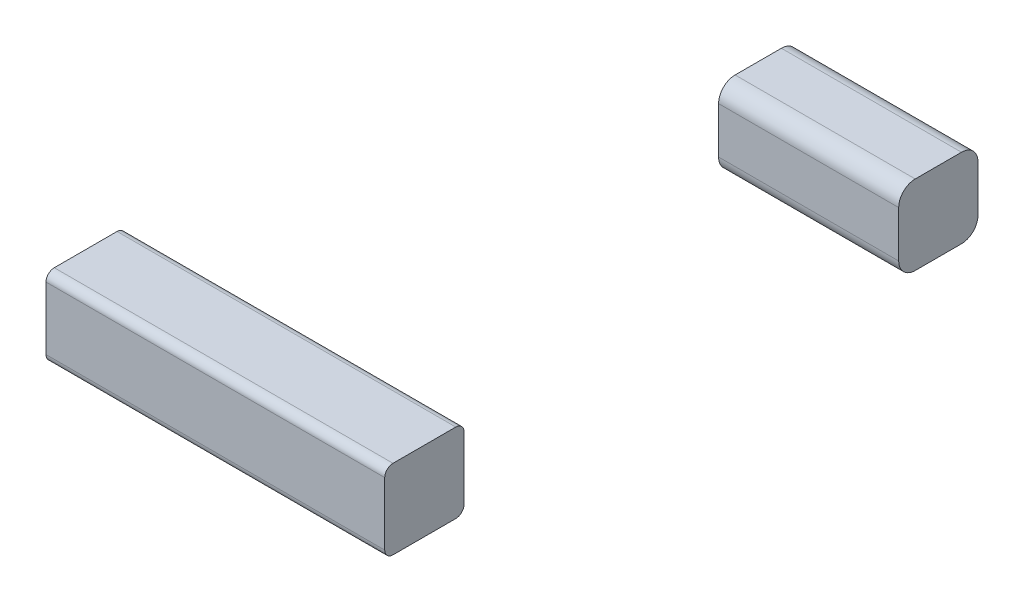
ISO-10303-21;
HEADER;
FILE_DESCRIPTION(('STEP AP214'),'2;1');
FILE_NAME('part.step','',(''),(''),'','','');
FILE_SCHEMA(('AUTOMOTIVE_DESIGN { 1 0 10303 214 1 1 1 1 }'));
ENDSEC;
DATA;
#1=APPLICATION_CONTEXT('core data for automotive mechanical design processes');
#2=APPLICATION_PROTOCOL_DEFINITION('international standard','automotive_design',2000,#1);
#3=PRODUCT_CONTEXT('',#1,'mechanical');
#4=PRODUCT('Part','Part','',(#3));
#5=PRODUCT_RELATED_PRODUCT_CATEGORY('part','',(#4));
#6=PRODUCT_DEFINITION_FORMATION('','',#4);
#7=PRODUCT_DEFINITION_CONTEXT('part definition',#1,'design');
#8=PRODUCT_DEFINITION('design','',#6,#7);
#9=PRODUCT_DEFINITION_SHAPE('','',#8);
#10=(LENGTH_UNIT() NAMED_UNIT(*) SI_UNIT(.MILLI.,.METRE.));
#11=(NAMED_UNIT(*) PLANE_ANGLE_UNIT() SI_UNIT($,.RADIAN.));
#12=(NAMED_UNIT(*) SI_UNIT($,.STERADIAN.) SOLID_ANGLE_UNIT());
#13=UNCERTAINTY_MEASURE_WITH_UNIT(LENGTH_MEASURE(1.E-05),#10,'distance_accuracy_value','');
#14=(GEOMETRIC_REPRESENTATION_CONTEXT(3) GLOBAL_UNCERTAINTY_ASSIGNED_CONTEXT((#13)) GLOBAL_UNIT_ASSIGNED_CONTEXT((#10,
#11,#12)) REPRESENTATION_CONTEXT('',''));
#15=CARTESIAN_POINT('',(0.,0.,0.));
#16=DIRECTION('',(0.,0.,1.));
#17=DIRECTION('',(1.,0.,0.));
#18=AXIS2_PLACEMENT_3D('',#15,#16,#17);
#19=CARTESIAN_POINT('',(10.9,0.,-62.9302493972376));
#20=DIRECTION('',(0.,0.,-1.));
#21=DIRECTION('',(-1.,0.,0.));
#22=AXIS2_PLACEMENT_3D('',#19,#20,#21);
#23=PLANE('',#22);
#24=DIRECTION('',(0.,-1.,0.));
#25=VECTOR('',#24,1.);
#26=CARTESIAN_POINT('',(0.,0.,-62.9302493972376));
#27=LINE('',#26,#25);
#28=CARTESIAN_POINT('',(0.,3.8,-62.9302493972376));
#29=VERTEX_POINT('',#28);
#30=CARTESIAN_POINT('',(0.,1.,-62.9302493972376));
#31=VERTEX_POINT('',#30);
#32=EDGE_CURVE('E140',#29,#31,#27,.T.);
#33=ORIENTED_EDGE('',*,*,#32,.T.);
#34=DIRECTION('',(-1.,0.,0.));
#35=VECTOR('',#34,1.);
#36=CARTESIAN_POINT('',(10.9,1.,-62.9302493972376));
#37=LINE('',#36,#35);
#38=CARTESIAN_POINT('',(10.9,1.,-62.9302493972376));
#39=VERTEX_POINT('',#38);
#40=EDGE_CURVE('E117',#31,#39,#37,.F.);
#41=ORIENTED_EDGE('',*,*,#40,.T.);
#42=DIRECTION('',(0.,-1.,0.));
#43=VECTOR('',#42,1.);
#44=CARTESIAN_POINT('',(10.9,0.,-62.9302493972376));
#45=LINE('',#44,#43);
#46=CARTESIAN_POINT('',(10.9,3.8,-62.9302493972376));
#47=VERTEX_POINT('',#46);
#48=EDGE_CURVE('E149',#47,#39,#45,.T.);
#49=ORIENTED_EDGE('',*,*,#48,.F.);
#50=DIRECTION('',(-1.,0.,0.));
#51=VECTOR('',#50,1.);
#52=CARTESIAN_POINT('',(10.9,3.8,-62.9302493972376));
#53=LINE('',#52,#51);
#54=EDGE_CURVE('E122',#47,#29,#53,.T.);
#55=ORIENTED_EDGE('',*,*,#54,.T.);
#56=EDGE_LOOP('',(#33,#41,#49,#55));
#57=FACE_BOUND('',#56,.T.);
#58=ADVANCED_FACE('F45',(#57),#23,.F.);
#59=CARTESIAN_POINT('',(10.9,0.,-62.9302493972376));
#60=DIRECTION('',(0.,1.,0.));
#61=DIRECTION('',(0.,0.,1.));
#62=AXIS2_PLACEMENT_3D('',#59,#60,#61);
#63=PLANE('',#62);
#64=DIRECTION('',(0.,0.,-1.));
#65=VECTOR('',#64,1.);
#66=CARTESIAN_POINT('',(10.9,0.,-62.9302493972376));
#67=LINE('',#66,#65);
#68=CARTESIAN_POINT('',(10.9,0.,-63.9302493972376));
#69=VERTEX_POINT('',#68);
#70=CARTESIAN_POINT('',(10.9,0.,-66.7302493972376));
#71=VERTEX_POINT('',#70);
#72=EDGE_CURVE('E132',#69,#71,#67,.T.);
#73=ORIENTED_EDGE('',*,*,#72,.F.);
#74=DIRECTION('',(-1.,0.,0.));
#75=VECTOR('',#74,1.);
#76=CARTESIAN_POINT('',(10.9,0.,-63.9302493972376));
#77=LINE('',#76,#75);
#78=CARTESIAN_POINT('',(0.,0.,-63.9302493972376));
#79=VERTEX_POINT('',#78);
#80=EDGE_CURVE('E116',#69,#79,#77,.T.);
#81=ORIENTED_EDGE('',*,*,#80,.T.);
#82=DIRECTION('',(0.,0.,-1.));
#83=VECTOR('',#82,1.);
#84=CARTESIAN_POINT('',(0.,0.,-62.9302493972376));
#85=LINE('',#84,#83);
#86=CARTESIAN_POINT('',(0.,0.,-66.7302493972376));
#87=VERTEX_POINT('',#86);
#88=EDGE_CURVE('E129',#79,#87,#85,.T.);
#89=ORIENTED_EDGE('',*,*,#88,.T.);
#90=DIRECTION('',(-1.,0.,0.));
#91=VECTOR('',#90,1.);
#92=CARTESIAN_POINT('',(10.9,0.,-66.7302493972376));
#93=LINE('',#92,#91);
#94=EDGE_CURVE('E134',#87,#71,#93,.F.);
#95=ORIENTED_EDGE('',*,*,#94,.T.);
#96=EDGE_LOOP('',(#73,#81,#89,#95));
#97=FACE_BOUND('',#96,.T.);
#98=ADVANCED_FACE('F128',(#97),#63,.F.);
#99=CARTESIAN_POINT('',(10.9,0.,-67.7302493972376));
#100=DIRECTION('',(0.,0.,1.));
#101=DIRECTION('',(1.,0.,0.));
#102=AXIS2_PLACEMENT_3D('',#99,#100,#101);
#103=PLANE('',#102);
#104=DIRECTION('',(0.,1.,0.));
#105=VECTOR('',#104,1.);
#106=CARTESIAN_POINT('',(10.9,0.,-67.7302493972376));
#107=LINE('',#106,#105);
#108=CARTESIAN_POINT('',(10.9,1.,-67.7302493972376));
#109=VERTEX_POINT('',#108);
#110=CARTESIAN_POINT('',(10.9,3.8,-67.7302493972376));
#111=VERTEX_POINT('',#110);
#112=EDGE_CURVE('E172',#109,#111,#107,.T.);
#113=ORIENTED_EDGE('',*,*,#112,.F.);
#114=DIRECTION('',(-1.,0.,0.));
#115=VECTOR('',#114,1.);
#116=CARTESIAN_POINT('',(10.9,1.,-67.7302493972376));
#117=LINE('',#116,#115);
#118=CARTESIAN_POINT('',(0.,1.,-67.7302493972376));
#119=VERTEX_POINT('',#118);
#120=EDGE_CURVE('E12',#109,#119,#117,.T.);
#121=ORIENTED_EDGE('',*,*,#120,.T.);
#122=DIRECTION('',(0.,1.,0.));
#123=VECTOR('',#122,1.);
#124=CARTESIAN_POINT('',(0.,0.,-67.7302493972376));
#125=LINE('',#124,#123);
#126=CARTESIAN_POINT('',(0.,3.8,-67.7302493972376));
#127=VERTEX_POINT('',#126);
#128=EDGE_CURVE('E139',#119,#127,#125,.T.);
#129=ORIENTED_EDGE('',*,*,#128,.T.);
#130=DIRECTION('',(-1.,0.,0.));
#131=VECTOR('',#130,1.);
#132=CARTESIAN_POINT('',(10.9,3.8,-67.7302493972376));
#133=LINE('',#132,#131);
#134=EDGE_CURVE('E53',#127,#111,#133,.F.);
#135=ORIENTED_EDGE('',*,*,#134,.T.);
#136=EDGE_LOOP('',(#113,#121,#129,#135));
#137=FACE_BOUND('',#136,.T.);
#138=ADVANCED_FACE('F171',(#137),#103,.F.);
#139=CARTESIAN_POINT('',(10.9,4.8,-62.9302493972376));
#140=DIRECTION('',(0.,-1.,0.));
#141=DIRECTION('',(0.,0.,-1.));
#142=AXIS2_PLACEMENT_3D('',#139,#140,#141);
#143=PLANE('',#142);
#144=DIRECTION('',(0.,0.,1.));
#145=VECTOR('',#144,1.);
#146=CARTESIAN_POINT('',(0.,4.8,-62.9302493972376));
#147=LINE('',#146,#145);
#148=CARTESIAN_POINT('',(0.,4.8,-66.7302493972376));
#149=VERTEX_POINT('',#148);
#150=CARTESIAN_POINT('',(0.,4.8,-63.9302493972376));
#151=VERTEX_POINT('',#150);
#152=EDGE_CURVE('E143',#149,#151,#147,.T.);
#153=ORIENTED_EDGE('',*,*,#152,.T.);
#154=DIRECTION('',(-1.,0.,0.));
#155=VECTOR('',#154,1.);
#156=CARTESIAN_POINT('',(10.9,4.8,-63.9302493972376));
#157=LINE('',#156,#155);
#158=CARTESIAN_POINT('',(10.9,4.8,-63.9302493972376));
#159=VERTEX_POINT('',#158);
#160=EDGE_CURVE('E60',#151,#159,#157,.F.);
#161=ORIENTED_EDGE('',*,*,#160,.T.);
#162=DIRECTION('',(0.,0.,1.));
#163=VECTOR('',#162,1.);
#164=CARTESIAN_POINT('',(10.9,4.8,-62.9302493972376));
#165=LINE('',#164,#163);
#166=CARTESIAN_POINT('',(10.9,4.8,-66.7302493972376));
#167=VERTEX_POINT('',#166);
#168=EDGE_CURVE('E150',#167,#159,#165,.T.);
#169=ORIENTED_EDGE('',*,*,#168,.F.);
#170=DIRECTION('',(-1.,0.,0.));
#171=VECTOR('',#170,1.);
#172=CARTESIAN_POINT('',(10.9,4.8,-66.7302493972376));
#173=LINE('',#172,#171);
#174=EDGE_CURVE('E165',#167,#149,#173,.T.);
#175=ORIENTED_EDGE('',*,*,#174,.T.);
#176=EDGE_LOOP('',(#153,#161,#169,#175));
#177=FACE_BOUND('',#176,.T.);
#178=ADVANCED_FACE('F181',(#177),#143,.F.);
#179=CARTESIAN_POINT('',(10.9,0.,0.));
#180=DIRECTION('',(-1.,0.,0.));
#181=DIRECTION('',(0.,0.,1.));
#182=AXIS2_PLACEMENT_3D('',#179,#180,#181);
#183=PLANE('',#182);
#184=ORIENTED_EDGE('',*,*,#48,.T.);
#185=CARTESIAN_POINT('',(10.9,1.,-63.9302493972376));
#186=DIRECTION('',(-1.,0.,0.));
#187=DIRECTION('',(0.,0.,1.));
#188=AXIS2_PLACEMENT_3D('',#185,#186,#187);
#189=CIRCLE('',#188,1.);
#190=EDGE_CURVE('E163',#39,#69,#189,.F.);
#191=ORIENTED_EDGE('',*,*,#190,.T.);
#192=ORIENTED_EDGE('',*,*,#72,.T.);
#193=CARTESIAN_POINT('',(10.9,1.,-66.7302493972376));
#194=DIRECTION('',(-1.,0.,0.));
#195=DIRECTION('',(0.,0.,1.));
#196=AXIS2_PLACEMENT_3D('',#193,#194,#195);
#197=CIRCLE('',#196,1.);
#198=EDGE_CURVE('E159',#71,#109,#197,.F.);
#199=ORIENTED_EDGE('',*,*,#198,.T.);
#200=ORIENTED_EDGE('',*,*,#112,.T.);
#201=CARTESIAN_POINT('',(10.9,3.8,-66.7302493972376));
#202=DIRECTION('',(-1.,0.,0.));
#203=DIRECTION('',(0.,0.,1.));
#204=AXIS2_PLACEMENT_3D('',#201,#202,#203);
#205=CIRCLE('',#204,1.);
#206=EDGE_CURVE('E67',#111,#167,#205,.F.);
#207=ORIENTED_EDGE('',*,*,#206,.T.);
#208=ORIENTED_EDGE('',*,*,#168,.T.);
#209=CARTESIAN_POINT('',(10.9,3.8,-63.9302493972376));
#210=DIRECTION('',(-1.,0.,0.));
#211=DIRECTION('',(0.,0.,1.));
#212=AXIS2_PLACEMENT_3D('',#209,#210,#211);
#213=CIRCLE('',#212,1.);
#214=EDGE_CURVE('E161',#159,#47,#213,.F.);
#215=ORIENTED_EDGE('',*,*,#214,.T.);
#216=EDGE_LOOP('',(#184,#191,#192,#199,#200,#207,#208,#215));
#217=FACE_BOUND('',#216,.T.);
#218=ADVANCED_FACE('F176',(#217),#183,.F.);
#219=CARTESIAN_POINT('',(0.,0.,0.));
#220=DIRECTION('',(-1.,0.,0.));
#221=DIRECTION('',(0.,0.,1.));
#222=AXIS2_PLACEMENT_3D('',#219,#220,#221);
#223=PLANE('',#222);
#224=ORIENTED_EDGE('',*,*,#88,.F.);
#225=CARTESIAN_POINT('',(0.,1.,-63.9302493972376));
#226=DIRECTION('',(-1.,0.,0.));
#227=DIRECTION('',(0.,0.,1.));
#228=AXIS2_PLACEMENT_3D('',#225,#226,#227);
#229=CIRCLE('',#228,1.);
#230=EDGE_CURVE('E112',#79,#31,#229,.T.);
#231=ORIENTED_EDGE('',*,*,#230,.T.);
#232=ORIENTED_EDGE('',*,*,#32,.F.);
#233=CARTESIAN_POINT('',(0.,3.8,-63.9302493972376));
#234=DIRECTION('',(-1.,0.,0.));
#235=DIRECTION('',(0.,0.,1.));
#236=AXIS2_PLACEMENT_3D('',#233,#234,#235);
#237=CIRCLE('',#236,1.);
#238=EDGE_CURVE('E123',#29,#151,#237,.T.);
#239=ORIENTED_EDGE('',*,*,#238,.T.);
#240=ORIENTED_EDGE('',*,*,#152,.F.);
#241=CARTESIAN_POINT('',(0.,3.8,-66.7302493972376));
#242=DIRECTION('',(-1.,0.,0.));
#243=DIRECTION('',(0.,0.,1.));
#244=AXIS2_PLACEMENT_3D('',#241,#242,#243);
#245=CIRCLE('',#244,1.);
#246=EDGE_CURVE('E133',#149,#127,#245,.T.);
#247=ORIENTED_EDGE('',*,*,#246,.T.);
#248=ORIENTED_EDGE('',*,*,#128,.F.);
#249=CARTESIAN_POINT('',(0.,1.,-66.7302493972376));
#250=DIRECTION('',(-1.,0.,0.));
#251=DIRECTION('',(0.,0.,1.));
#252=AXIS2_PLACEMENT_3D('',#249,#250,#251);
#253=CIRCLE('',#252,1.);
#254=EDGE_CURVE('E138',#119,#87,#253,.T.);
#255=ORIENTED_EDGE('',*,*,#254,.T.);
#256=EDGE_LOOP('',(#224,#231,#232,#239,#240,#247,#248,#255));
#257=FACE_BOUND('',#256,.T.);
#258=ADVANCED_FACE('F136',(#257),#223,.T.);
#259=CARTESIAN_POINT('',(10.9,1.,-63.9302493972376));
#260=DIRECTION('',(-1.,0.,0.));
#261=DIRECTION('',(0.,0.,1.));
#262=AXIS2_PLACEMENT_3D('',#259,#260,#261);
#263=CYLINDRICAL_SURFACE('',#262,1.);
#264=ORIENTED_EDGE('',*,*,#190,.F.);
#265=ORIENTED_EDGE('',*,*,#40,.F.);
#266=ORIENTED_EDGE('',*,*,#230,.F.);
#267=ORIENTED_EDGE('',*,*,#80,.F.);
#268=EDGE_LOOP('',(#264,#265,#266,#267));
#269=FACE_BOUND('',#268,.T.);
#270=ADVANCED_FACE('F115',(#269),#263,.T.);
#271=CARTESIAN_POINT('',(10.9,3.8,-63.9302493972376));
#272=DIRECTION('',(-1.,0.,0.));
#273=DIRECTION('',(0.,0.,1.));
#274=AXIS2_PLACEMENT_3D('',#271,#272,#273);
#275=CYLINDRICAL_SURFACE('',#274,1.);
#276=ORIENTED_EDGE('',*,*,#214,.F.);
#277=ORIENTED_EDGE('',*,*,#160,.F.);
#278=ORIENTED_EDGE('',*,*,#238,.F.);
#279=ORIENTED_EDGE('',*,*,#54,.F.);
#280=EDGE_LOOP('',(#276,#277,#278,#279));
#281=FACE_BOUND('',#280,.T.);
#282=ADVANCED_FACE('F185',(#281),#275,.T.);
#283=CARTESIAN_POINT('',(10.9,1.,-66.7302493972376));
#284=DIRECTION('',(-1.,0.,0.));
#285=DIRECTION('',(0.,0.,1.));
#286=AXIS2_PLACEMENT_3D('',#283,#284,#285);
#287=CYLINDRICAL_SURFACE('',#286,1.);
#288=ORIENTED_EDGE('',*,*,#198,.F.);
#289=ORIENTED_EDGE('',*,*,#94,.F.);
#290=ORIENTED_EDGE('',*,*,#254,.F.);
#291=ORIENTED_EDGE('',*,*,#120,.F.);
#292=EDGE_LOOP('',(#288,#289,#290,#291));
#293=FACE_BOUND('',#292,.T.);
#294=ADVANCED_FACE('F191',(#293),#287,.T.);
#295=CARTESIAN_POINT('',(10.9,3.8,-66.7302493972376));
#296=DIRECTION('',(-1.,0.,0.));
#297=DIRECTION('',(0.,0.,1.));
#298=AXIS2_PLACEMENT_3D('',#295,#296,#297);
#299=CYLINDRICAL_SURFACE('',#298,1.);
#300=ORIENTED_EDGE('',*,*,#206,.F.);
#301=ORIENTED_EDGE('',*,*,#134,.F.);
#302=ORIENTED_EDGE('',*,*,#246,.F.);
#303=ORIENTED_EDGE('',*,*,#174,.F.);
#304=EDGE_LOOP('',(#300,#301,#302,#303));
#305=FACE_BOUND('',#304,.T.);
#306=ADVANCED_FACE('F47',(#305),#299,.T.);
#307=CLOSED_SHELL('',(#58,#98,#138,#178,#218,#258,#270,#282,#294,#306));
#308=MANIFOLD_SOLID_BREP('B2',#307);
#309=CARTESIAN_POINT('',(10.,0.,-32.7247889230842));
#310=DIRECTION('',(0.,0.,-1.));
#311=DIRECTION('',(-1.,0.,0.));
#312=AXIS2_PLACEMENT_3D('',#309,#310,#311);
#313=PLANE('',#312);
#314=DIRECTION('',(-1.,0.,0.));
#315=VECTOR('',#314,1.);
#316=CARTESIAN_POINT('',(10.,4.3,-32.7247889230842));
#317=LINE('',#316,#315);
#318=CARTESIAN_POINT('',(10.,4.3,-32.7247889230842));
#319=VERTEX_POINT('',#318);
#320=CARTESIAN_POINT('',(-10.5,4.3,-32.7247889230842));
#321=VERTEX_POINT('',#320);
#322=EDGE_CURVE('E280',#319,#321,#317,.T.);
#323=ORIENTED_EDGE('',*,*,#322,.T.);
#324=DIRECTION('',(0.,1.,0.));
#325=VECTOR('',#324,1.);
#326=CARTESIAN_POINT('',(-10.5,0.5,-32.7247889230842));
#327=LINE('',#326,#325);
#328=CARTESIAN_POINT('',(-10.5,0.5,-32.7247889230842));
#329=VERTEX_POINT('',#328);
#330=EDGE_CURVE('E362',#329,#321,#327,.T.);
#331=ORIENTED_EDGE('',*,*,#330,.F.);
#332=DIRECTION('',(-1.,0.,0.));
#333=VECTOR('',#332,1.);
#334=CARTESIAN_POINT('',(10.,0.5,-32.7247889230842));
#335=LINE('',#334,#333);
#336=CARTESIAN_POINT('',(10.,0.5,-32.7247889230842));
#337=VERTEX_POINT('',#336);
#338=EDGE_CURVE('E43',#329,#337,#335,.F.);
#339=ORIENTED_EDGE('',*,*,#338,.T.);
#340=DIRECTION('',(0.,-1.,0.));
#341=VECTOR('',#340,1.);
#342=CARTESIAN_POINT('',(10.,0.,-32.7247889230842));
#343=LINE('',#342,#341);
#344=EDGE_CURVE('E378',#319,#337,#343,.T.);
#345=ORIENTED_EDGE('',*,*,#344,.F.);
#346=EDGE_LOOP('',(#323,#331,#339,#345));
#347=FACE_BOUND('',#346,.T.);
#348=ADVANCED_FACE('F272',(#347),#313,.F.);
#349=CARTESIAN_POINT('',(10.,0.,-32.7247889230842));
#350=DIRECTION('',(0.,1.,0.));
#351=DIRECTION('',(0.,0.,1.));
#352=AXIS2_PLACEMENT_3D('',#349,#350,#351);
#353=PLANE('',#352);
#354=DIRECTION('',(-1.,0.,0.));
#355=VECTOR('',#354,1.);
#356=CARTESIAN_POINT('',(10.,0.,-33.2247889230842));
#357=LINE('',#356,#355);
#358=CARTESIAN_POINT('',(10.,0.,-33.2247889230842));
#359=VERTEX_POINT('',#358);
#360=CARTESIAN_POINT('',(-10.5,0.,-33.2247889230842));
#361=VERTEX_POINT('',#360);
#362=EDGE_CURVE('E397',#359,#361,#357,.T.);
#363=ORIENTED_EDGE('',*,*,#362,.T.);
#364=DIRECTION('',(0.,0.,1.));
#365=VECTOR('',#364,1.);
#366=CARTESIAN_POINT('',(-10.5,0.,-37.0247889230842));
#367=LINE('',#366,#365);
#368=CARTESIAN_POINT('',(-10.5,0.,-37.0247889230842));
#369=VERTEX_POINT('',#368);
#370=EDGE_CURVE('E372',#369,#361,#367,.T.);
#371=ORIENTED_EDGE('',*,*,#370,.F.);
#372=DIRECTION('',(-1.,0.,0.));
#373=VECTOR('',#372,1.);
#374=CARTESIAN_POINT('',(10.,0.,-37.0247889230842));
#375=LINE('',#374,#373);
#376=CARTESIAN_POINT('',(10.,0.,-37.0247889230842));
#377=VERTEX_POINT('',#376);
#378=EDGE_CURVE('E287',#369,#377,#375,.F.);
#379=ORIENTED_EDGE('',*,*,#378,.T.);
#380=DIRECTION('',(0.,0.,-1.));
#381=VECTOR('',#380,1.);
#382=CARTESIAN_POINT('',(10.,0.,-32.7247889230842));
#383=LINE('',#382,#381);
#384=EDGE_CURVE('E380',#359,#377,#383,.T.);
#385=ORIENTED_EDGE('',*,*,#384,.F.);
#386=EDGE_LOOP('',(#363,#371,#379,#385));
#387=FACE_BOUND('',#386,.T.);
#388=ADVANCED_FACE('F406',(#387),#353,.F.);
#389=CARTESIAN_POINT('',(10.,0.,-37.5247889230842));
#390=DIRECTION('',(0.,0.,1.));
#391=DIRECTION('',(1.,0.,0.));
#392=AXIS2_PLACEMENT_3D('',#389,#390,#391);
#393=PLANE('',#392);
#394=DIRECTION('',(-1.,0.,0.));
#395=VECTOR('',#394,1.);
#396=CARTESIAN_POINT('',(10.,0.5,-37.5247889230842));
#397=LINE('',#396,#395);
#398=CARTESIAN_POINT('',(10.,0.5,-37.5247889230842));
#399=VERTEX_POINT('',#398);
#400=CARTESIAN_POINT('',(-10.5,0.5,-37.5247889230842));
#401=VERTEX_POINT('',#400);
#402=EDGE_CURVE('E387',#399,#401,#397,.T.);
#403=ORIENTED_EDGE('',*,*,#402,.T.);
#404=DIRECTION('',(0.,-1.,0.));
#405=VECTOR('',#404,1.);
#406=CARTESIAN_POINT('',(-10.5,4.3,-37.5247889230842));
#407=LINE('',#406,#405);
#408=CARTESIAN_POINT('',(-10.5,4.3,-37.5247889230842));
#409=VERTEX_POINT('',#408);
#410=EDGE_CURVE('E366',#409,#401,#407,.T.);
#411=ORIENTED_EDGE('',*,*,#410,.F.);
#412=DIRECTION('',(-1.,0.,0.));
#413=VECTOR('',#412,1.);
#414=CARTESIAN_POINT('',(10.,4.3,-37.5247889230842));
#415=LINE('',#414,#413);
#416=CARTESIAN_POINT('',(10.,4.3,-37.5247889230842));
#417=VERTEX_POINT('',#416);
#418=EDGE_CURVE('E389',#409,#417,#415,.F.);
#419=ORIENTED_EDGE('',*,*,#418,.T.);
#420=DIRECTION('',(0.,1.,0.));
#421=VECTOR('',#420,1.);
#422=CARTESIAN_POINT('',(10.,0.,-37.5247889230842));
#423=LINE('',#422,#421);
#424=EDGE_CURVE('E382',#399,#417,#423,.T.);
#425=ORIENTED_EDGE('',*,*,#424,.F.);
#426=EDGE_LOOP('',(#403,#411,#419,#425));
#427=FACE_BOUND('',#426,.T.);
#428=ADVANCED_FACE('F416',(#427),#393,.F.);
#429=CARTESIAN_POINT('',(10.,4.8,-32.7247889230842));
#430=DIRECTION('',(0.,-1.,0.));
#431=DIRECTION('',(0.,0.,-1.));
#432=AXIS2_PLACEMENT_3D('',#429,#430,#431);
#433=PLANE('',#432);
#434=DIRECTION('',(0.,0.,1.));
#435=VECTOR('',#434,1.);
#436=CARTESIAN_POINT('',(10.,4.8,-32.7247889230842));
#437=LINE('',#436,#435);
#438=CARTESIAN_POINT('',(10.,4.8,-37.0247889230842));
#439=VERTEX_POINT('',#438);
#440=CARTESIAN_POINT('',(10.,4.8,-33.2247889230842));
#441=VERTEX_POINT('',#440);
#442=EDGE_CURVE('E347',#439,#441,#437,.T.);
#443=ORIENTED_EDGE('',*,*,#442,.F.);
#444=DIRECTION('',(-1.,0.,0.));
#445=VECTOR('',#444,1.);
#446=CARTESIAN_POINT('',(10.,4.8,-37.0247889230842));
#447=LINE('',#446,#445);
#448=CARTESIAN_POINT('',(-10.5,4.8,-37.0247889230842));
#449=VERTEX_POINT('',#448);
#450=EDGE_CURVE('E346',#439,#449,#447,.T.);
#451=ORIENTED_EDGE('',*,*,#450,.T.);
#452=DIRECTION('',(0.,0.,-1.));
#453=VECTOR('',#452,1.);
#454=CARTESIAN_POINT('',(-10.5,4.8,-33.2247889230842));
#455=LINE('',#454,#453);
#456=CARTESIAN_POINT('',(-10.5,4.8,-33.2247889230842));
#457=VERTEX_POINT('',#456);
#458=EDGE_CURVE('E350',#457,#449,#455,.T.);
#459=ORIENTED_EDGE('',*,*,#458,.F.);
#460=DIRECTION('',(-1.,0.,0.));
#461=VECTOR('',#460,1.);
#462=CARTESIAN_POINT('',(10.,4.8,-33.2247889230842));
#463=LINE('',#462,#461);
#464=EDGE_CURVE('E337',#457,#441,#463,.F.);
#465=ORIENTED_EDGE('',*,*,#464,.T.);
#466=EDGE_LOOP('',(#443,#451,#459,#465));
#467=FACE_BOUND('',#466,.T.);
#468=ADVANCED_FACE('F351',(#467),#433,.F.);
#469=CARTESIAN_POINT('',(10.,0.,0.));
#470=DIRECTION('',(-1.,0.,0.));
#471=DIRECTION('',(0.,0.,1.));
#472=AXIS2_PLACEMENT_3D('',#469,#470,#471);
#473=PLANE('',#472);
#474=ORIENTED_EDGE('',*,*,#424,.T.);
#475=CARTESIAN_POINT('',(10.,4.3,-37.0247889230842));
#476=DIRECTION('',(-1.,0.,0.));
#477=DIRECTION('',(0.,0.,1.));
#478=AXIS2_PLACEMENT_3D('',#475,#476,#477);
#479=CIRCLE('',#478,0.5);
#480=EDGE_CURVE('E395',#417,#439,#479,.F.);
#481=ORIENTED_EDGE('',*,*,#480,.T.);
#482=ORIENTED_EDGE('',*,*,#442,.T.);
#483=CARTESIAN_POINT('',(10.,4.3,-33.2247889230842));
#484=DIRECTION('',(-1.,0.,0.));
#485=DIRECTION('',(0.,0.,1.));
#486=AXIS2_PLACEMENT_3D('',#483,#484,#485);
#487=CIRCLE('',#486,0.5);
#488=EDGE_CURVE('E342',#441,#319,#487,.F.);
#489=ORIENTED_EDGE('',*,*,#488,.T.);
#490=ORIENTED_EDGE('',*,*,#344,.T.);
#491=CARTESIAN_POINT('',(10.,0.5,-33.2247889230842));
#492=DIRECTION('',(-1.,0.,0.));
#493=DIRECTION('',(0.,0.,1.));
#494=AXIS2_PLACEMENT_3D('',#491,#492,#493);
#495=CIRCLE('',#494,0.5);
#496=EDGE_CURVE('E294',#337,#359,#495,.F.);
#497=ORIENTED_EDGE('',*,*,#496,.T.);
#498=ORIENTED_EDGE('',*,*,#384,.T.);
#499=CARTESIAN_POINT('',(10.,0.5,-37.0247889230842));
#500=DIRECTION('',(-1.,0.,0.));
#501=DIRECTION('',(0.,0.,1.));
#502=AXIS2_PLACEMENT_3D('',#499,#500,#501);
#503=CIRCLE('',#502,0.5);
#504=EDGE_CURVE('E393',#377,#399,#503,.F.);
#505=ORIENTED_EDGE('',*,*,#504,.T.);
#506=EDGE_LOOP('',(#474,#481,#482,#489,#490,#497,#498,#505));
#507=FACE_BOUND('',#506,.T.);
#508=ADVANCED_FACE('F401',(#507),#473,.F.);
#509=CARTESIAN_POINT('',(10.,4.3,-37.0247889230842));
#510=DIRECTION('',(-1.,0.,0.));
#511=DIRECTION('',(0.,0.,1.));
#512=AXIS2_PLACEMENT_3D('',#509,#510,#511);
#513=CYLINDRICAL_SURFACE('',#512,0.5);
#514=ORIENTED_EDGE('',*,*,#480,.F.);
#515=ORIENTED_EDGE('',*,*,#418,.F.);
#516=CARTESIAN_POINT('',(-10.5,4.3,-37.0247889230842));
#517=DIRECTION('',(-1.,0.,0.));
#518=DIRECTION('',(0.,0.,1.));
#519=AXIS2_PLACEMENT_3D('',#516,#517,#518);
#520=CIRCLE('',#519,0.5);
#521=EDGE_CURVE('E356',#449,#409,#520,.T.);
#522=ORIENTED_EDGE('',*,*,#521,.F.);
#523=ORIENTED_EDGE('',*,*,#450,.F.);
#524=EDGE_LOOP('',(#514,#515,#522,#523));
#525=FACE_BOUND('',#524,.T.);
#526=ADVANCED_FACE('F418',(#525),#513,.T.);
#527=CARTESIAN_POINT('',(10.,0.5,-37.0247889230842));
#528=DIRECTION('',(-1.,0.,0.));
#529=DIRECTION('',(0.,0.,1.));
#530=AXIS2_PLACEMENT_3D('',#527,#528,#529);
#531=CYLINDRICAL_SURFACE('',#530,0.5);
#532=ORIENTED_EDGE('',*,*,#504,.F.);
#533=ORIENTED_EDGE('',*,*,#378,.F.);
#534=CARTESIAN_POINT('',(-10.5,0.5,-37.0247889230842));
#535=DIRECTION('',(-1.,0.,0.));
#536=DIRECTION('',(0.,0.,1.));
#537=AXIS2_PLACEMENT_3D('',#534,#535,#536);
#538=CIRCLE('',#537,0.5);
#539=EDGE_CURVE('E369',#401,#369,#538,.T.);
#540=ORIENTED_EDGE('',*,*,#539,.F.);
#541=ORIENTED_EDGE('',*,*,#402,.F.);
#542=EDGE_LOOP('',(#532,#533,#540,#541));
#543=FACE_BOUND('',#542,.T.);
#544=ADVANCED_FACE('F412',(#543),#531,.T.);
#545=CARTESIAN_POINT('',(10.,0.5,-33.2247889230842));
#546=DIRECTION('',(-1.,0.,0.));
#547=DIRECTION('',(0.,0.,1.));
#548=AXIS2_PLACEMENT_3D('',#545,#546,#547);
#549=CYLINDRICAL_SURFACE('',#548,0.5);
#550=ORIENTED_EDGE('',*,*,#496,.F.);
#551=ORIENTED_EDGE('',*,*,#338,.F.);
#552=CARTESIAN_POINT('',(-10.5,0.5,-33.2247889230842));
#553=DIRECTION('',(-1.,0.,0.));
#554=DIRECTION('',(0.,0.,1.));
#555=AXIS2_PLACEMENT_3D('',#552,#553,#554);
#556=CIRCLE('',#555,0.5);
#557=EDGE_CURVE('E375',#361,#329,#556,.T.);
#558=ORIENTED_EDGE('',*,*,#557,.F.);
#559=ORIENTED_EDGE('',*,*,#362,.F.);
#560=EDGE_LOOP('',(#550,#551,#558,#559));
#561=FACE_BOUND('',#560,.T.);
#562=ADVANCED_FACE('F404',(#561),#549,.T.);
#563=CARTESIAN_POINT('',(10.,4.3,-33.2247889230842));
#564=DIRECTION('',(-1.,0.,0.));
#565=DIRECTION('',(0.,0.,1.));
#566=AXIS2_PLACEMENT_3D('',#563,#564,#565);
#567=CYLINDRICAL_SURFACE('',#566,0.5);
#568=ORIENTED_EDGE('',*,*,#488,.F.);
#569=ORIENTED_EDGE('',*,*,#464,.F.);
#570=CARTESIAN_POINT('',(-10.5,4.3,-33.2247889230842));
#571=DIRECTION('',(-1.,0.,0.));
#572=DIRECTION('',(0.,0.,1.));
#573=AXIS2_PLACEMENT_3D('',#570,#571,#572);
#574=CIRCLE('',#573,0.5);
#575=EDGE_CURVE('E341',#321,#457,#574,.T.);
#576=ORIENTED_EDGE('',*,*,#575,.F.);
#577=ORIENTED_EDGE('',*,*,#322,.F.);
#578=EDGE_LOOP('',(#568,#569,#576,#577));
#579=FACE_BOUND('',#578,.T.);
#580=ADVANCED_FACE('F274',(#579),#567,.T.);
#581=CARTESIAN_POINT('',(-10.5,4.3,-33.2247889230842));
#582=DIRECTION('',(-1.,0.,0.));
#583=DIRECTION('',(0.,0.,1.));
#584=AXIS2_PLACEMENT_3D('',#581,#582,#583);
#585=PLANE('',#584);
#586=ORIENTED_EDGE('',*,*,#575,.T.);
#587=ORIENTED_EDGE('',*,*,#458,.T.);
#588=ORIENTED_EDGE('',*,*,#521,.T.);
#589=ORIENTED_EDGE('',*,*,#410,.T.);
#590=ORIENTED_EDGE('',*,*,#539,.T.);
#591=ORIENTED_EDGE('',*,*,#370,.T.);
#592=ORIENTED_EDGE('',*,*,#557,.T.);
#593=ORIENTED_EDGE('',*,*,#330,.T.);
#594=EDGE_LOOP('',(#586,#587,#588,#589,#590,#591,#592,#593));
#595=FACE_BOUND('',#594,.T.);
#596=ADVANCED_FACE('F359',(#595),#585,.T.);
#597=CLOSED_SHELL('',(#348,#388,#428,#468,#508,#526,#544,#562,#580,#596));
#598=MANIFOLD_SOLID_BREP('B6',#597);
#599=ADVANCED_BREP_SHAPE_REPRESENTATION('',(#18,#308,#598),#14);
#600=SHAPE_DEFINITION_REPRESENTATION(#9,#599);
ENDSEC;
END-ISO-10303-21;
